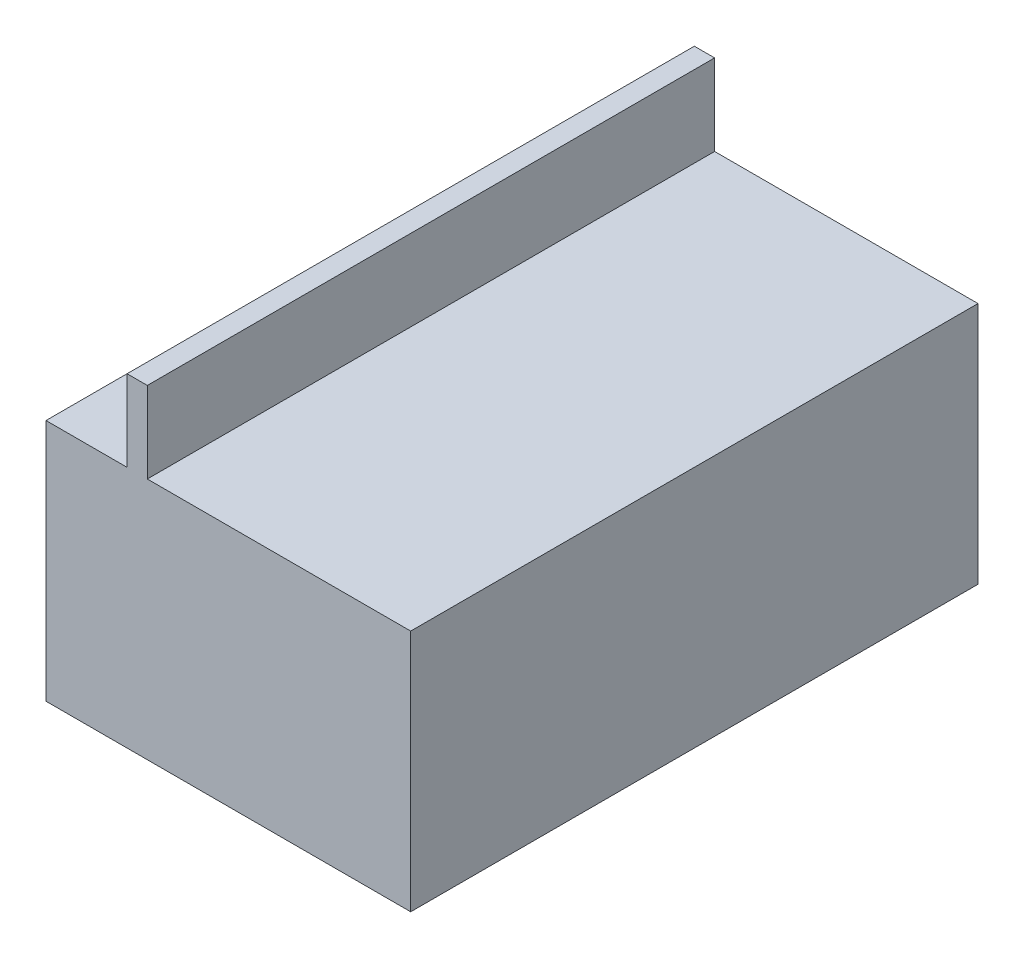
ISO-10303-21;
HEADER;
FILE_DESCRIPTION(('STEP AP214'),'2;1');
FILE_NAME('part.step','',(''),(''),'','','');
FILE_SCHEMA(('AUTOMOTIVE_DESIGN { 1 0 10303 214 1 1 1 1 }'));
ENDSEC;
DATA;
#1=APPLICATION_CONTEXT('core data for automotive mechanical design processes');
#2=APPLICATION_PROTOCOL_DEFINITION('international standard','automotive_design',2000,#1);
#3=PRODUCT_CONTEXT('',#1,'mechanical');
#4=PRODUCT('Part','Part','',(#3));
#5=PRODUCT_RELATED_PRODUCT_CATEGORY('part','',(#4));
#6=PRODUCT_DEFINITION_FORMATION('','',#4);
#7=PRODUCT_DEFINITION_CONTEXT('part definition',#1,'design');
#8=PRODUCT_DEFINITION('design','',#6,#7);
#9=PRODUCT_DEFINITION_SHAPE('','',#8);
#10=(LENGTH_UNIT() NAMED_UNIT(*) SI_UNIT(.MILLI.,.METRE.));
#11=(NAMED_UNIT(*) PLANE_ANGLE_UNIT() SI_UNIT($,.RADIAN.));
#12=(NAMED_UNIT(*) SI_UNIT($,.STERADIAN.) SOLID_ANGLE_UNIT());
#13=UNCERTAINTY_MEASURE_WITH_UNIT(LENGTH_MEASURE(1.E-05),#10,'distance_accuracy_value','');
#14=(GEOMETRIC_REPRESENTATION_CONTEXT(3) GLOBAL_UNCERTAINTY_ASSIGNED_CONTEXT((#13)) GLOBAL_UNIT_ASSIGNED_CONTEXT((#10,
#11,#12)) REPRESENTATION_CONTEXT('',''));
#15=CARTESIAN_POINT('',(0.,0.,0.));
#16=DIRECTION('',(0.,0.,1.));
#17=DIRECTION('',(1.,0.,0.));
#18=AXIS2_PLACEMENT_3D('',#15,#16,#17);
#19=CARTESIAN_POINT('',(0.,60.,0.));
#20=DIRECTION('',(0.,1.,0.));
#21=DIRECTION('',(0.,0.,1.));
#22=AXIS2_PLACEMENT_3D('',#19,#20,#21);
#23=PLANE('',#22);
#24=DIRECTION('',(0.,0.,1.));
#25=VECTOR('',#24,1.);
#26=CARTESIAN_POINT('',(20.,60.,0.));
#27=LINE('',#26,#25);
#28=CARTESIAN_POINT('',(20.,60.,0.));
#29=VERTEX_POINT('',#28);
#30=CARTESIAN_POINT('',(20.,60.,140.));
#31=VERTEX_POINT('',#30);
#32=EDGE_CURVE('E54',#29,#31,#27,.T.);
#33=ORIENTED_EDGE('',*,*,#32,.F.);
#34=DIRECTION('',(-1.,0.,0.));
#35=VECTOR('',#34,1.);
#36=CARTESIAN_POINT('',(0.,60.,0.));
#37=LINE('',#36,#35);
#38=CARTESIAN_POINT('',(0.,60.,0.));
#39=VERTEX_POINT('',#38);
#40=EDGE_CURVE('E143',#29,#39,#37,.T.);
#41=ORIENTED_EDGE('',*,*,#40,.T.);
#42=DIRECTION('',(0.,0.,1.));
#43=VECTOR('',#42,1.);
#44=CARTESIAN_POINT('',(0.,60.,0.));
#45=LINE('',#44,#43);
#46=CARTESIAN_POINT('',(0.,60.,140.));
#47=VERTEX_POINT('',#46);
#48=EDGE_CURVE('E134',#39,#47,#45,.T.);
#49=ORIENTED_EDGE('',*,*,#48,.T.);
#50=DIRECTION('',(1.,0.,0.));
#51=VECTOR('',#50,1.);
#52=CARTESIAN_POINT('',(0.,60.,140.));
#53=LINE('',#52,#51);
#54=EDGE_CURVE('E139',#47,#31,#53,.T.);
#55=ORIENTED_EDGE('',*,*,#54,.T.);
#56=EDGE_LOOP('',(#33,#41,#49,#55));
#57=FACE_BOUND('',#56,.T.);
#58=ADVANCED_FACE('F39',(#57),#23,.T.);
#59=CARTESIAN_POINT('',(0.,60.,0.));
#60=DIRECTION('',(1.,0.,0.));
#61=DIRECTION('',(0.,0.,-1.));
#62=AXIS2_PLACEMENT_3D('',#59,#60,#61);
#63=PLANE('',#62);
#64=DIRECTION('',(0.,0.,1.));
#65=VECTOR('',#64,1.);
#66=CARTESIAN_POINT('',(0.,0.,0.));
#67=LINE('',#66,#65);
#68=CARTESIAN_POINT('',(0.,0.,0.));
#69=VERTEX_POINT('',#68);
#70=CARTESIAN_POINT('',(0.,0.,140.));
#71=VERTEX_POINT('',#70);
#72=EDGE_CURVE('E125',#69,#71,#67,.T.);
#73=ORIENTED_EDGE('',*,*,#72,.T.);
#74=DIRECTION('',(0.,-1.,0.));
#75=VECTOR('',#74,1.);
#76=CARTESIAN_POINT('',(0.,60.,140.));
#77=LINE('',#76,#75);
#78=EDGE_CURVE('E11',#47,#71,#77,.T.);
#79=ORIENTED_EDGE('',*,*,#78,.F.);
#80=ORIENTED_EDGE('',*,*,#48,.F.);
#81=DIRECTION('',(0.,-1.,0.));
#82=VECTOR('',#81,1.);
#83=CARTESIAN_POINT('',(0.,60.,0.));
#84=LINE('',#83,#82);
#85=EDGE_CURVE('E145',#39,#69,#84,.T.);
#86=ORIENTED_EDGE('',*,*,#85,.T.);
#87=EDGE_LOOP('',(#73,#79,#80,#86));
#88=FACE_BOUND('',#87,.T.);
#89=ADVANCED_FACE('F41',(#88),#63,.F.);
#90=CARTESIAN_POINT('',(0.,60.,140.));
#91=DIRECTION('',(0.,0.,-1.));
#92=DIRECTION('',(-1.,0.,0.));
#93=AXIS2_PLACEMENT_3D('',#90,#91,#92);
#94=PLANE('',#93);
#95=DIRECTION('',(1.,0.,0.));
#96=VECTOR('',#95,1.);
#97=CARTESIAN_POINT('',(0.,0.,140.));
#98=LINE('',#97,#96);
#99=CARTESIAN_POINT('',(90.,0.,140.));
#100=VERTEX_POINT('',#99);
#101=EDGE_CURVE('E128',#71,#100,#98,.T.);
#102=ORIENTED_EDGE('',*,*,#101,.T.);
#103=DIRECTION('',(0.,-1.,0.));
#104=VECTOR('',#103,1.);
#105=CARTESIAN_POINT('',(90.,60.,140.));
#106=LINE('',#105,#104);
#107=CARTESIAN_POINT('',(90.,60.,140.));
#108=VERTEX_POINT('',#107);
#109=EDGE_CURVE('E47',#108,#100,#106,.T.);
#110=ORIENTED_EDGE('',*,*,#109,.F.);
#111=CARTESIAN_POINT('',(25.,60.,140.));
#112=VERTEX_POINT('',#111);
#113=EDGE_CURVE('E137',#112,#108,#53,.T.);
#114=ORIENTED_EDGE('',*,*,#113,.F.);
#115=DIRECTION('',(0.,-1.,0.));
#116=VECTOR('',#115,1.);
#117=CARTESIAN_POINT('',(25.,80.,140.));
#118=LINE('',#117,#116);
#119=CARTESIAN_POINT('',(25.,80.,140.));
#120=VERTEX_POINT('',#119);
#121=EDGE_CURVE('E110',#120,#112,#118,.T.);
#122=ORIENTED_EDGE('',*,*,#121,.F.);
#123=DIRECTION('',(1.,0.,0.));
#124=VECTOR('',#123,1.);
#125=CARTESIAN_POINT('',(20.,80.,140.));
#126=LINE('',#125,#124);
#127=CARTESIAN_POINT('',(20.,80.,140.));
#128=VERTEX_POINT('',#127);
#129=EDGE_CURVE('E104',#128,#120,#126,.T.);
#130=ORIENTED_EDGE('',*,*,#129,.F.);
#131=DIRECTION('',(0.,-1.,0.));
#132=VECTOR('',#131,1.);
#133=CARTESIAN_POINT('',(20.,80.,140.));
#134=LINE('',#133,#132);
#135=EDGE_CURVE('E108',#128,#31,#134,.T.);
#136=ORIENTED_EDGE('',*,*,#135,.T.);
#137=ORIENTED_EDGE('',*,*,#54,.F.);
#138=ORIENTED_EDGE('',*,*,#78,.T.);
#139=EDGE_LOOP('',(#102,#110,#114,#122,#130,#136,#137,#138));
#140=FACE_BOUND('',#139,.T.);
#141=ADVANCED_FACE('F106',(#140),#94,.F.);
#142=CARTESIAN_POINT('',(90.,60.,0.));
#143=DIRECTION('',(-1.,0.,0.));
#144=DIRECTION('',(0.,0.,1.));
#145=AXIS2_PLACEMENT_3D('',#142,#143,#144);
#146=PLANE('',#145);
#147=DIRECTION('',(0.,0.,-1.));
#148=VECTOR('',#147,1.);
#149=CARTESIAN_POINT('',(90.,0.,0.));
#150=LINE('',#149,#148);
#151=CARTESIAN_POINT('',(90.,0.,0.));
#152=VERTEX_POINT('',#151);
#153=EDGE_CURVE('E148',#100,#152,#150,.T.);
#154=ORIENTED_EDGE('',*,*,#153,.T.);
#155=DIRECTION('',(0.,-1.,0.));
#156=VECTOR('',#155,1.);
#157=CARTESIAN_POINT('',(90.,60.,0.));
#158=LINE('',#157,#156);
#159=CARTESIAN_POINT('',(90.,60.,0.));
#160=VERTEX_POINT('',#159);
#161=EDGE_CURVE('E153',#160,#152,#158,.T.);
#162=ORIENTED_EDGE('',*,*,#161,.F.);
#163=DIRECTION('',(0.,0.,-1.));
#164=VECTOR('',#163,1.);
#165=CARTESIAN_POINT('',(90.,60.,0.));
#166=LINE('',#165,#164);
#167=EDGE_CURVE('E141',#108,#160,#166,.T.);
#168=ORIENTED_EDGE('',*,*,#167,.F.);
#169=ORIENTED_EDGE('',*,*,#109,.T.);
#170=EDGE_LOOP('',(#154,#162,#168,#169));
#171=FACE_BOUND('',#170,.T.);
#172=ADVANCED_FACE('F160',(#171),#146,.F.);
#173=CARTESIAN_POINT('',(0.,60.,0.));
#174=DIRECTION('',(0.,0.,1.));
#175=DIRECTION('',(1.,0.,0.));
#176=AXIS2_PLACEMENT_3D('',#173,#174,#175);
#177=PLANE('',#176);
#178=DIRECTION('',(-1.,0.,0.));
#179=VECTOR('',#178,1.);
#180=CARTESIAN_POINT('',(0.,0.,0.));
#181=LINE('',#180,#179);
#182=EDGE_CURVE('E138',#152,#69,#181,.T.);
#183=ORIENTED_EDGE('',*,*,#182,.T.);
#184=ORIENTED_EDGE('',*,*,#85,.F.);
#185=ORIENTED_EDGE('',*,*,#40,.F.);
#186=DIRECTION('',(0.,-1.,0.));
#187=VECTOR('',#186,1.);
#188=CARTESIAN_POINT('',(20.,80.,0.));
#189=LINE('',#188,#187);
#190=CARTESIAN_POINT('',(20.,80.,0.));
#191=VERTEX_POINT('',#190);
#192=EDGE_CURVE('E173',#191,#29,#189,.T.);
#193=ORIENTED_EDGE('',*,*,#192,.F.);
#194=DIRECTION('',(-1.,0.,0.));
#195=VECTOR('',#194,1.);
#196=CARTESIAN_POINT('',(20.,80.,0.));
#197=LINE('',#196,#195);
#198=CARTESIAN_POINT('',(25.,80.,0.));
#199=VERTEX_POINT('',#198);
#200=EDGE_CURVE('E119',#199,#191,#197,.T.);
#201=ORIENTED_EDGE('',*,*,#200,.F.);
#202=DIRECTION('',(0.,-1.,0.));
#203=VECTOR('',#202,1.);
#204=CARTESIAN_POINT('',(25.,80.,0.));
#205=LINE('',#204,#203);
#206=CARTESIAN_POINT('',(25.,60.,0.));
#207=VERTEX_POINT('',#206);
#208=EDGE_CURVE('E130',#199,#207,#205,.T.);
#209=ORIENTED_EDGE('',*,*,#208,.T.);
#210=EDGE_CURVE('E144',#160,#207,#37,.T.);
#211=ORIENTED_EDGE('',*,*,#210,.F.);
#212=ORIENTED_EDGE('',*,*,#161,.T.);
#213=EDGE_LOOP('',(#183,#184,#185,#193,#201,#209,#211,#212));
#214=FACE_BOUND('',#213,.T.);
#215=ADVANCED_FACE('F168',(#214),#177,.F.);
#216=DIRECTION('',(0.,0.,-1.));
#217=VECTOR('',#216,1.);
#218=CARTESIAN_POINT('',(25.,60.,0.));
#219=LINE('',#218,#217);
#220=EDGE_CURVE('E62',#112,#207,#219,.T.);
#221=ORIENTED_EDGE('',*,*,#220,.F.);
#222=ORIENTED_EDGE('',*,*,#113,.T.);
#223=ORIENTED_EDGE('',*,*,#167,.T.);
#224=ORIENTED_EDGE('',*,*,#210,.T.);
#225=EDGE_LOOP('',(#221,#222,#223,#224));
#226=FACE_BOUND('',#225,.T.);
#227=ADVANCED_FACE('F183',(#226),#23,.T.);
#228=CARTESIAN_POINT('',(0.,0.,0.));
#229=DIRECTION('',(0.,1.,0.));
#230=DIRECTION('',(0.,0.,1.));
#231=AXIS2_PLACEMENT_3D('',#228,#229,#230);
#232=PLANE('',#231);
#233=ORIENTED_EDGE('',*,*,#72,.F.);
#234=ORIENTED_EDGE('',*,*,#182,.F.);
#235=ORIENTED_EDGE('',*,*,#153,.F.);
#236=ORIENTED_EDGE('',*,*,#101,.F.);
#237=EDGE_LOOP('',(#233,#234,#235,#236));
#238=FACE_BOUND('',#237,.T.);
#239=ADVANCED_FACE('F165',(#238),#232,.F.);
#240=CARTESIAN_POINT('',(20.,80.,0.));
#241=DIRECTION('',(1.,0.,0.));
#242=DIRECTION('',(0.,0.,-1.));
#243=AXIS2_PLACEMENT_3D('',#240,#241,#242);
#244=PLANE('',#243);
#245=ORIENTED_EDGE('',*,*,#32,.T.);
#246=ORIENTED_EDGE('',*,*,#135,.F.);
#247=DIRECTION('',(0.,0.,1.));
#248=VECTOR('',#247,1.);
#249=CARTESIAN_POINT('',(20.,80.,0.));
#250=LINE('',#249,#248);
#251=EDGE_CURVE('E114',#191,#128,#250,.T.);
#252=ORIENTED_EDGE('',*,*,#251,.F.);
#253=ORIENTED_EDGE('',*,*,#192,.T.);
#254=EDGE_LOOP('',(#245,#246,#252,#253));
#255=FACE_BOUND('',#254,.T.);
#256=ADVANCED_FACE('F124',(#255),#244,.F.);
#257=CARTESIAN_POINT('',(25.,80.,0.));
#258=DIRECTION('',(-1.,0.,0.));
#259=DIRECTION('',(0.,0.,1.));
#260=AXIS2_PLACEMENT_3D('',#257,#258,#259);
#261=PLANE('',#260);
#262=ORIENTED_EDGE('',*,*,#220,.T.);
#263=ORIENTED_EDGE('',*,*,#208,.F.);
#264=DIRECTION('',(0.,0.,-1.));
#265=VECTOR('',#264,1.);
#266=CARTESIAN_POINT('',(25.,80.,0.));
#267=LINE('',#266,#265);
#268=EDGE_CURVE('E113',#120,#199,#267,.T.);
#269=ORIENTED_EDGE('',*,*,#268,.F.);
#270=ORIENTED_EDGE('',*,*,#121,.T.);
#271=EDGE_LOOP('',(#262,#263,#269,#270));
#272=FACE_BOUND('',#271,.T.);
#273=ADVANCED_FACE('F182',(#272),#261,.F.);
#274=CARTESIAN_POINT('',(0.,80.,0.));
#275=DIRECTION('',(0.,1.,0.));
#276=DIRECTION('',(0.,0.,1.));
#277=AXIS2_PLACEMENT_3D('',#274,#275,#276);
#278=PLANE('',#277);
#279=ORIENTED_EDGE('',*,*,#251,.T.);
#280=ORIENTED_EDGE('',*,*,#129,.T.);
#281=ORIENTED_EDGE('',*,*,#268,.T.);
#282=ORIENTED_EDGE('',*,*,#200,.T.);
#283=EDGE_LOOP('',(#279,#280,#281,#282));
#284=FACE_BOUND('',#283,.T.);
#285=ADVANCED_FACE('F117',(#284),#278,.T.);
#286=CLOSED_SHELL('',(#58,#89,#141,#172,#215,#227,#239,#256,#273,#285));
#287=MANIFOLD_SOLID_BREP('B2',#286);
#288=ADVANCED_BREP_SHAPE_REPRESENTATION('',(#18,#287),#14);
#289=SHAPE_DEFINITION_REPRESENTATION(#9,#288);
ENDSEC;
END-ISO-10303-21;
